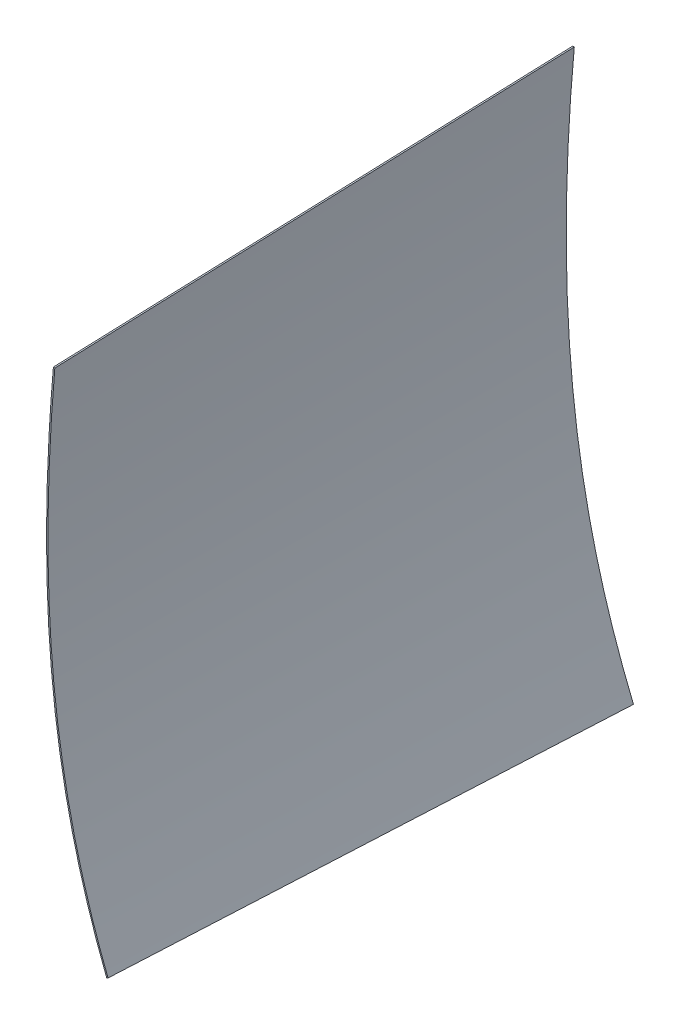
ISO-10303-21;
HEADER;
FILE_DESCRIPTION(('STEP AP214'),'2;1');
FILE_NAME('part.step','',(''),(''),'','','');
FILE_SCHEMA(('AUTOMOTIVE_DESIGN { 1 0 10303 214 1 1 1 1 }'));
ENDSEC;
DATA;
#1=APPLICATION_CONTEXT('core data for automotive mechanical design processes');
#2=APPLICATION_PROTOCOL_DEFINITION('international standard','automotive_design',2000,#1);
#3=PRODUCT_CONTEXT('',#1,'mechanical');
#4=PRODUCT('Part','Part','',(#3));
#5=PRODUCT_RELATED_PRODUCT_CATEGORY('part','',(#4));
#6=PRODUCT_DEFINITION_FORMATION('','',#4);
#7=PRODUCT_DEFINITION_CONTEXT('part definition',#1,'design');
#8=PRODUCT_DEFINITION('design','',#6,#7);
#9=PRODUCT_DEFINITION_SHAPE('','',#8);
#10=(LENGTH_UNIT() NAMED_UNIT(*) SI_UNIT(.MILLI.,.METRE.));
#11=(NAMED_UNIT(*) PLANE_ANGLE_UNIT() SI_UNIT($,.RADIAN.));
#12=(NAMED_UNIT(*) SI_UNIT($,.STERADIAN.) SOLID_ANGLE_UNIT());
#13=UNCERTAINTY_MEASURE_WITH_UNIT(LENGTH_MEASURE(1.E-05),#10,'distance_accuracy_value','');
#14=(GEOMETRIC_REPRESENTATION_CONTEXT(3) GLOBAL_UNCERTAINTY_ASSIGNED_CONTEXT((#13)) GLOBAL_UNIT_ASSIGNED_CONTEXT((#10,
#11,#12)) REPRESENTATION_CONTEXT('',''));
#15=CARTESIAN_POINT('',(0.,0.,0.));
#16=DIRECTION('',(0.,0.,1.));
#17=DIRECTION('',(1.,0.,0.));
#18=AXIS2_PLACEMENT_3D('',#15,#16,#17);
#19=CARTESIAN_POINT('',(-466.611140214611,-2996.06608357652,-18.9639705593638));
#20=DIRECTION('',(-0.0340355254361657,0.,-0.999420623665676));
#21=DIRECTION('',(0.999420623665674,0.,-0.0340355254361649));
#22=AXIS2_PLACEMENT_3D('',#19,#20,#21);
#23=PLANE('',#22);
#24=CARTESIAN_POINT('',(-403.930987283559,-3259.1200239438,-21.0985592289505));
#25=CARTESIAN_POINT('',(-445.733833689982,-3153.75817323705,-19.67495258278));
#26=CARTESIAN_POINT('',(-468.70121232971,-3041.49687790168,-18.8927926179128));
#27=CARTESIAN_POINT('',(-474.470158611008,-2827.19923017659,-18.696329674035));
#28=CARTESIAN_POINT('',(-470.84962488944,-2750.93837704816,-18.8196278776696));
#29=CARTESIAN_POINT('',(-464.732969148089,-2683.51000000006,-19.027932156308));
#30=B_SPLINE_CURVE_WITH_KNOTS('',3,(#24,#25,#26,#27,#28,#29),.UNSPECIFIED.,.F.,.F.,(4,2,4),
(-56.739502562534,-25.56106888728,-9.08244148966291),.UNSPECIFIED.);
#31=CARTESIAN_POINT('',(-403.930987283559,-3259.1200239438,-21.0985592289505));
#32=VERTEX_POINT('',#31);
#33=CARTESIAN_POINT('',(-464.732969148083,-2683.51,-19.027932156308));
#34=VERTEX_POINT('',#33);
#35=EDGE_CURVE('E292',#32,#34,#30,.T.);
#36=ORIENTED_EDGE('',*,*,#35,.F.);
#37=DIRECTION('',(0.928901332385208,0.368973720543161,-0.0316339729013444));
#38=VECTOR('',#37,1.);
#39=CARTESIAN_POINT('',(-403.930987283559,-3259.1200239438,-21.0985592289505));
#40=LINE('',#39,#38);
#41=CARTESIAN_POINT('',(-405.346632914115,-3259.68233989391,-21.0503490542484));
#42=VERTEX_POINT('',#41);
#43=EDGE_CURVE('E11',#42,#32,#40,.T.);
#44=ORIENTED_EDGE('',*,*,#43,.F.);
#45=CARTESIAN_POINT('',(-466.24985061128,-2683.37223897629,-18.9762743693844));
#46=CARTESIAN_POINT('',(-466.52800454726,-2686.43853357676,-18.9668017658189));
#47=CARTESIAN_POINT('',(-467.068754704631,-2692.54817563492,-18.9483863806448));
#48=CARTESIAN_POINT('',(-468.112754832752,-2704.96556617701,-18.9128326887609));
#49=CARTESIAN_POINT('',(-469.330675907016,-2720.70635667756,-18.8713560744898));
#50=CARTESIAN_POINT('',(-470.642951911992,-2739.94017213858,-18.8266661788754));
#51=CARTESIAN_POINT('',(-472.173825744938,-2765.96523019636,-18.7745318782149));
#52=CARTESIAN_POINT('',(-473.643484071331,-2799.09279437813,-18.7244822873156));
#53=CARTESIAN_POINT('',(-474.584547280483,-2839.41721128649,-18.6924341385843));
#54=CARTESIAN_POINT('',(-474.597234534264,-2879.89590932481,-18.6920020709058));
#55=CARTESIAN_POINT('',(-473.552843034611,-2920.24749419559,-18.7275690910473));
#56=CARTESIAN_POINT('',(-471.451298298135,-2959.00502041135,-18.7991377355603));
#57=CARTESIAN_POINT('',(-467.251493918508,-3008.90219119633,-18.9421631498901));
#58=CARTESIAN_POINT('',(-459.380692331025,-3068.11953927663,-19.2102053148107));
#59=CARTESIAN_POINT('',(-445.756996624254,-3135.03979825284,-19.6741637631179));
#60=CARTESIAN_POINT('',(-430.934378251676,-3188.07769701693,-20.1789518300286));
#61=CARTESIAN_POINT('',(-417.001753178614,-3229.31217603775,-20.6534309470667));
#62=CARTESIAN_POINT('',(-409.347475200825,-3249.59842973105,-20.9140993449761));
#63=CARTESIAN_POINT('',(-405.346632914115,-3259.68233989391,-21.0503490542484));
#64=B_SPLINE_CURVE_WITH_KNOTS('',3,(#45,#46,#47,#48,#49,#50,#51,#52,#53,#54,#55,#56,#57,#58,#59,
#60,#61,#62,#63),.UNSPECIFIED.,.F.,.F.,(4,1,1,1,1,1,1,1,1,1,1,1,1,1,1,1,4),(-56.7395025625342,
-55.9948609832705,-55.2502194040068,-53.7609362454794,-52.271653086952,-50.7823699284246,
-47.8038036113698,-44.8252372943149,-41.8466709772601,-38.8681046602053,-35.8895383431505,
-32.9109720260957,-26.9538393919861,-20.9967067578765,-15.0395741237669,-12.0610078067121,
-9.08244148965729),.UNSPECIFIED.);
#65=CARTESIAN_POINT('',(-466.24985061128,-2683.37223897629,-18.9762743693844));
#66=VERTEX_POINT('',#65);
#67=EDGE_CURVE('E47',#66,#42,#64,.T.);
#68=ORIENTED_EDGE('',*,*,#67,.F.);
#69=DIRECTION('',(-0.995329044093503,0.0903943725162506,0.0338961856453834));
#70=VECTOR('',#69,1.);
#71=CARTESIAN_POINT('',(-464.732969148083,-2683.51,-19.027932156308));
#72=LINE('',#71,#70);
#73=EDGE_CURVE('E151',#34,#66,#72,.T.);
#74=ORIENTED_EDGE('',*,*,#73,.F.);
#75=EDGE_LOOP('',(#36,#44,#68,#74));
#76=FACE_BOUND('',#75,.T.);
#77=ADVANCED_FACE('F37',(#76),#23,.T.);
#78=CARTESIAN_POINT('',(-446.435916270369,-2973.01654152757,552.449999999997));
#79=DIRECTION('',(0.,0.,-1.));
#80=DIRECTION('',(1.,0.,0.));
#81=AXIS2_PLACEMENT_3D('',#78,#79,#80);
#82=PLANE('',#81);
#83=CARTESIAN_POINT('',(-445.27114172974,-2683.51,552.449999999998));
#84=CARTESIAN_POINT('',(-450.721614948777,-2745.57602142326,552.449999999998));
#85=CARTESIAN_POINT('',(-453.875260666029,-2815.15896694759,552.449999999998));
#86=CARTESIAN_POINT('',(-448.538626648824,-3013.430965814,552.449999999998));
#87=CARTESIAN_POINT('',(-427.328274562888,-3118.30445867765,552.449999999998));
#88=CARTESIAN_POINT('',(-388.74883320951,-3216.60244101189,552.449999999999));
#89=B_SPLINE_CURVE_WITH_KNOTS('',3,(#83,#84,#85,#86,#87,#88),.UNSPECIFIED.,.F.,.F.,(4,2,4),
(-53.1349686655124,-38.0838438024245,-9.03456928373366),.UNSPECIFIED.);
#90=CARTESIAN_POINT('',(-445.27114172974,-2683.51,552.449999999998));
#91=VERTEX_POINT('',#90);
#92=CARTESIAN_POINT('',(-388.74883320951,-3216.60244101189,552.449999999999));
#93=VERTEX_POINT('',#92);
#94=EDGE_CURVE('E93',#91,#93,#89,.T.);
#95=ORIENTED_EDGE('',*,*,#94,.F.);
#96=DIRECTION('',(0.996166217031828,-0.0874806724053839,0.));
#97=VECTOR('',#96,1.);
#98=CARTESIAN_POINT('',(-445.27114172974,-2683.51,552.449999999998));
#99=LINE('',#98,#97);
#100=CARTESIAN_POINT('',(-446.789299044496,-2683.37667945526,552.449999999998));
#101=VERTEX_POINT('',#100);
#102=EDGE_CURVE('E105',#101,#91,#99,.T.);
#103=ORIENTED_EDGE('',*,*,#102,.F.);
#104=CARTESIAN_POINT('',(-390.16748320148,-3217.1592248122,552.449999999999));
#105=CARTESIAN_POINT('',(-393.835931652234,-3207.81224962655,552.449999999999));
#106=CARTESIAN_POINT('',(-400.853820334561,-3189.01432562217,552.449999999999));
#107=CARTESIAN_POINT('',(-413.641001817294,-3150.79551758123,552.449999999998));
#108=CARTESIAN_POINT('',(-427.264915015265,-3101.64576821892,552.449999999998));
#109=CARTESIAN_POINT('',(-439.826984081324,-3039.67173926073,552.449999999997));
#110=CARTESIAN_POINT('',(-447.127533927637,-2984.88729053723,552.449999999997));
#111=CARTESIAN_POINT('',(-451.06175416571,-2938.77653944781,552.449999999997));
#112=CARTESIAN_POINT('',(-452.724263374413,-2908.94187235699,552.449999999997));
#113=CARTESIAN_POINT('',(-453.577877688286,-2884.37336277367,552.449999999997));
#114=CARTESIAN_POINT('',(-454.10627755663,-2859.4667689179,552.449999999997));
#115=CARTESIAN_POINT('',(-454.165478379712,-2828.26453296398,552.449999999997));
#116=CARTESIAN_POINT('',(-453.380335328475,-2790.9185255314,552.449999999997));
#117=CARTESIAN_POINT('',(-452.09337534734,-2760.19726274656,552.449999999998));
#118=CARTESIAN_POINT('',(-450.733957511632,-2736.02940774471,552.449999999998));
#119=CARTESIAN_POINT('',(-449.561553012373,-2718.14988851083,552.449999999998));
#120=CARTESIAN_POINT('',(-448.468208407518,-2703.49986711604,552.449999999998));
#121=CARTESIAN_POINT('',(-447.528245891984,-2691.9325270238,552.449999999998));
#122=CARTESIAN_POINT('',(-447.040334870055,-2686.23529269873,552.449999999998));
#123=CARTESIAN_POINT('',(-446.789299044496,-2683.37667945526,552.449999999998));
#124=B_SPLINE_CURVE_WITH_KNOTS('',3,(#104,#105,#106,#107,#108,#109,#110,#111,#112,#113,#114,
#115,#116,#117,#118,#119,#120,#121,#122,#123),.UNSPECIFIED.,.F.,.F.,(4,1,1,1,1,1,1,1,1,1,1,1,1,
1,1,1,1,4),(-53.1349686655124,-50.3786937041512,-47.6224187427901,-42.1098688200677,
-36.5973188973454,-31.084768974623,-28.3284940132619,-25.5722190519007,-24.1940815712201,
-22.8159440905395,-20.0596691291783,-17.3033941678172,-14.547119206456,-13.1689817257754,
-11.7908442450948,-10.4127067644142,-9.72363802407395,-9.03456928373366),.UNSPECIFIED.);
#125=CARTESIAN_POINT('',(-390.16748320148,-3217.1592248122,552.449999999999));
#126=VERTEX_POINT('',#125);
#127=EDGE_CURVE('E96',#126,#101,#124,.T.);
#128=ORIENTED_EDGE('',*,*,#127,.F.);
#129=DIRECTION('',(-0.930872698143799,-0.365343700986461,0.));
#130=VECTOR('',#129,1.);
#131=CARTESIAN_POINT('',(-388.74883320951,-3216.60244101189,552.449999999999));
#132=LINE('',#131,#130);
#133=EDGE_CURVE('E80',#93,#126,#132,.T.);
#134=ORIENTED_EDGE('',*,*,#133,.F.);
#135=EDGE_LOOP('',(#95,#103,#128,#134));
#136=FACE_BOUND('',#135,.T.);
#137=ADVANCED_FACE('F91',(#136),#82,.F.);
#138=CARTESIAN_POINT('',(-388.74883320951,-3216.60244101189,552.449999999999));
#139=CARTESIAN_POINT('',(-393.809551234193,-3230.77496865587,361.267146923683));
#140=CARTESIAN_POINT('',(-398.870269258875,-3244.94749629983,170.084293847366));
#141=CARTESIAN_POINT('',(-403.930987283559,-3259.1200239438,-21.0985592289505));
#142=CARTESIAN_POINT('',(-396.069879947334,-3197.94887585756,552.449999999999));
#143=CARTESIAN_POINT('',(-401.352613939785,-3211.62890949383,361.357814441903));
#144=CARTESIAN_POINT('',(-406.635347932235,-3225.3089431301,170.265628883808));
#145=CARTESIAN_POINT('',(-411.918081924685,-3238.98897676636,-20.8265566742876));
#146=CARTESIAN_POINT('',(-409.462453802416,-3160.1633580475,552.449999999999));
#147=CARTESIAN_POINT('',(-415.148035207749,-3172.84747091845,361.523562691919));
#148=CARTESIAN_POINT('',(-420.833616613079,-3185.53158378938,170.597125383837));
#149=CARTESIAN_POINT('',(-426.519198018413,-3198.21569666032,-20.3293119242431));
#150=CARTESIAN_POINT('',(-425.77920252708,-3101.29956753378,552.449999999998));
#151=CARTESIAN_POINT('',(-431.943278671712,-3112.43172360443,361.725081639181));
#152=CARTESIAN_POINT('',(-438.107354816344,-3123.56387967509,171.000163278365));
#153=CARTESIAN_POINT('',(-444.271430960977,-3134.69603574574,-19.7247550824509));
#154=CARTESIAN_POINT('',(-436.234798255945,-3049.72310201449,552.449999999999));
#155=CARTESIAN_POINT('',(-442.694501806457,-3059.47823062877,361.853838636825));
#156=CARTESIAN_POINT('',(-449.15420535697,-3069.23335924305,171.257677273652));
#157=CARTESIAN_POINT('',(-455.613908907483,-3078.98848785733,-19.3384840895217));
#158=CARTESIAN_POINT('',(-442.695163646222,-3006.60229322652,552.449999999995));
#159=CARTESIAN_POINT('',(-449.327146150586,-3015.19936674817,361.933042107011));
#160=CARTESIAN_POINT('',(-455.959128654953,-3023.79644026981,171.416084214028));
#161=CARTESIAN_POINT('',(-462.591111159319,-3032.39351379145,-19.1008736789566));
#162=CARTESIAN_POINT('',(-446.595338289244,-2973.20952160743,552.449999999998));
#163=CARTESIAN_POINT('',(-453.325842237494,-2980.89808891288,361.980671095654));
#164=CARTESIAN_POINT('',(-460.05634618574,-2988.58665621833,171.51134219131));
#165=CARTESIAN_POINT('',(-466.786850133986,-2996.27522352377,-18.9579867130343));
#166=CARTESIAN_POINT('',(-449.540346440592,-2938.66280502973,552.449999999997));
#167=CARTESIAN_POINT('',(-456.337060732763,-2945.40868607614,362.016356908295));
#168=CARTESIAN_POINT('',(-463.133775024936,-2952.15456712255,171.582713816592));
#169=CARTESIAN_POINT('',(-469.930489317107,-2958.90044816896,-18.8509292751098));
#170=CARTESIAN_POINT('',(-451.53540564562,-2902.92639756038,552.449999999996));
#171=CARTESIAN_POINT('',(-458.367464028044,-2908.67912835782,362.040207977829));
#172=CARTESIAN_POINT('',(-465.199522410469,-2914.43185915525,171.630415955661));
#173=CARTESIAN_POINT('',(-472.031580792892,-2920.18458995268,-18.7793760665063));
#174=CARTESIAN_POINT('',(-452.571553541693,-2865.70482179759,552.449999999998));
#175=CARTESIAN_POINT('',(-459.405821753868,-2870.4300086038,362.052045328184));
#176=CARTESIAN_POINT('',(-466.240089966043,-2875.15519541001,171.654090656371));
#177=CARTESIAN_POINT('',(-473.074358178216,-2879.88038221622,-18.743864015442));
#178=CARTESIAN_POINT('',(-452.640725782512,-2828.27319493841,552.449999999998));
#179=CARTESIAN_POINT('',(-459.447415375366,-2831.9942461404,362.051891357365));
#180=CARTESIAN_POINT('',(-466.254104968221,-2835.71529734239,171.653782714733));
#181=CARTESIAN_POINT('',(-473.060794561072,-2839.43634854438,-18.7443259278988));
#182=CARTESIAN_POINT('',(-451.857406362833,-2790.96907925551,552.449999999998));
#183=CARTESIAN_POINT('',(-458.612141519539,-2793.69391470801,362.041229987876));
#184=CARTESIAN_POINT('',(-465.366876676243,-2796.41875016052,171.632459975754));
#185=CARTESIAN_POINT('',(-472.121611832945,-2799.14358561301,-18.7763100363671));
#186=CARTESIAN_POINT('',(-450.313701225434,-2754.13084657163,552.449999999997));
#187=CARTESIAN_POINT('',(-456.995351268354,-2755.89498847126,362.021217297591));
#188=CARTESIAN_POINT('',(-463.677001311274,-2757.65913037089,171.592434595184));
#189=CARTESIAN_POINT('',(-470.358651354194,-2759.42327227052,-18.8363481072216));
#190=CARTESIAN_POINT('',(-448.111630814615,-2718.11246333902,552.449999999998));
#191=CARTESIAN_POINT('',(-454.703379029596,-2718.95838307462,361.993158310433));
#192=CARTESIAN_POINT('',(-461.295127244577,-2719.80430281023,171.536316620869));
#193=CARTESIAN_POINT('',(-467.886875459559,-2720.65022254584,-18.9205250686957));
#194=CARTESIAN_POINT('',(-446.269273297836,-2694.87599572168,552.449999999998));
#195=CARTESIAN_POINT('',(-452.79237382238,-2695.14996441787,361.969906509968));
#196=CARTESIAN_POINT('',(-459.315474346923,-2695.42393311407,171.489813019939));
#197=CARTESIAN_POINT('',(-465.838574871466,-2695.69790181027,-18.9902804700912));
#198=CARTESIAN_POINT('',(-445.27114172974,-2683.51,552.449999999998));
#199=CARTESIAN_POINT('',(-451.758417535858,-2683.51000000002,361.957355947896));
#200=CARTESIAN_POINT('',(-458.245693341971,-2683.51000000004,171.464711895794));
#201=CARTESIAN_POINT('',(-464.732969148089,-2683.51000000006,-19.027932156308));
#202=B_SPLINE_SURFACE_WITH_KNOTS('',3,3,((#138,#139,#140,#141),(#142,#143,#144,#145),(#146,#147,
#148,#149),(#150,#151,#152,#153),(#154,#155,#156,#157),(#158,#159,#160,#161),(#162,#163,#164,
#165),(#166,#167,#168,#169),(#170,#171,#172,#173),(#174,#175,#176,#177),(#178,#179,#180,#181),
(#182,#183,#184,#185),(#186,#187,#188,#189),(#190,#191,#192,#193),(#194,#195,#196,#197),(#198,
#199,#200,#201)),.UNSPECIFIED.,.F.,.F.,.F.,(4,1,1,1,1,1,1,1,1,1,1,1,1,4),(4,4),
(0.501665890350855,0.563957654056998,0.626249417763141,0.688541181469285,0.719687063322356,
0.750832945175428,0.781978827028499,0.813124708881571,0.844270590734642,0.875416472587714,
0.906562354440785,0.937708236293857,0.968854118146928,1.),(0.,1.),.UNSPECIFIED.);
#203=CARTESIAN_POINT('',(-388.74883320951,-3216.60244101189,552.449999999999));
#204=CARTESIAN_POINT('',(-393.809551234193,-3230.77496865587,361.267146923683));
#205=CARTESIAN_POINT('',(-398.870269258875,-3244.94749629983,170.084293847366));
#206=CARTESIAN_POINT('',(-403.930987283559,-3259.1200239438,-21.0985592289505));
#207=B_SPLINE_CURVE_WITH_KNOTS('',3,(#203,#204,#205,#206),.UNSPECIFIED.,.F.,.F.,(4,4),(0.,1.),.UNSPECIFIED.);
#208=EDGE_CURVE('E62',#93,#32,#207,.T.);
#209=CARTESIAN_POINT('',(-445.27114172974,-2683.51,552.449999999998));
#210=CARTESIAN_POINT('',(-451.758417535855,-2683.51,361.957355947896));
#211=CARTESIAN_POINT('',(-458.245693341967,-2683.51,171.464711895794));
#212=CARTESIAN_POINT('',(-464.732969148083,-2683.51,-19.027932156308));
#213=B_SPLINE_CURVE_WITH_KNOTS('',3,(#209,#210,#211,#212),.UNSPECIFIED.,.F.,.F.,(4,4),(0.,1.),.UNSPECIFIED.);
#214=EDGE_CURVE('E86',#91,#34,#213,.T.);
#215=ORIENTED_EDGE('',*,*,#94,.T.);
#216=ORIENTED_EDGE('',*,*,#208,.T.);
#217=ORIENTED_EDGE('',*,*,#35,.T.);
#218=ORIENTED_EDGE('',*,*,#214,.F.);
#219=EDGE_LOOP('',(#215,#216,#217,#218));
#220=FACE_BOUND('',#219,.T.);
#221=ADVANCED_FACE('F103',(#220),#202,.F.);
#222=CARTESIAN_POINT('',(-390.16748320148,-3217.1592248122,552.449999999999));
#223=CARTESIAN_POINT('',(-395.227199772356,-3231.3335965061,361.283216981916));
#224=CARTESIAN_POINT('',(-400.286916343237,-3245.50796820001,170.116433963834));
#225=CARTESIAN_POINT('',(-405.346632914115,-3259.68233989391,-21.0503490542484));
#226=CARTESIAN_POINT('',(-390.049262368816,-3217.11282616217,552.449999999999));
#227=CARTESIAN_POINT('',(-395.109062394178,-3231.28704418525,361.281877810397));
#228=CARTESIAN_POINT('',(-400.168862419538,-3245.46126220832,170.113755620795));
#229=CARTESIAN_POINT('',(-405.2286624449,-3259.6354802314,-21.0543665688068));
#230=CARTESIAN_POINT('',(-389.812820703488,-3217.02002886213,552.449999999999));
#231=CARTESIAN_POINT('',(-394.872787637816,-3231.19393954355,361.279199467359));
#232=CARTESIAN_POINT('',(-399.932754572146,-3245.36785022497,170.108398934717));
#233=CARTESIAN_POINT('',(-404.992721506476,-3259.54176090638,-21.0624015979244));
#234=CARTESIAN_POINT('',(-389.458158205493,-3216.88083291204,552.449999999998));
#235=CARTESIAN_POINT('',(-394.518375503275,-3231.05428258098,361.275181952799));
#236=CARTESIAN_POINT('',(-399.578592801056,-3245.22773224992,170.1003639056));
#237=CARTESIAN_POINT('',(-404.638810098837,-3259.40118191886,-21.0744541415995));
#238=CARTESIAN_POINT('',(-389.103495707503,-3216.74163696197,552.449999999999));
#239=CARTESIAN_POINT('',(-394.163963368735,-3230.91462561843,361.271164438241));
#240=CARTESIAN_POINT('',(-399.224431029965,-3245.08761427488,170.092328876483));
#241=CARTESIAN_POINT('',(-404.284898691199,-3259.26060293133,-21.0865066852746));
#242=CARTESIAN_POINT('',(-388.867054042175,-3216.64883966192,552.449999999999));
#243=CARTESIAN_POINT('',(-393.927688612374,-3230.82152097672,361.268486095202));
#244=CARTESIAN_POINT('',(-398.988323182573,-3244.99420229152,170.086972190405));
#245=CARTESIAN_POINT('',(-404.048957752773,-3259.16688360631,-21.0945417143913));
#246=CARTESIAN_POINT('',(-388.74883320951,-3216.60244101189,552.449999999999));
#247=CARTESIAN_POINT('',(-393.809551234193,-3230.77496865587,361.267146923683));
#248=CARTESIAN_POINT('',(-398.870269258875,-3244.94749629983,170.084293847366));
#249=CARTESIAN_POINT('',(-403.930987283559,-3259.1200239438,-21.0985592289505));
#250=B_SPLINE_SURFACE_WITH_KNOTS('',3,3,((#222,#223,#224,#225),(#226,#227,#228,#229),(#230,#231,
#232,#233),(#234,#235,#236,#237),(#238,#239,#240,#241),(#242,#243,#244,#245),(#246,#247,#248,
#249)),.UNSPECIFIED.,.F.,.F.,.F.,(4,1,1,1,4),(4,4),(0.500314223497019,0.500652140210478,
0.500990056923937,0.501327973637396,0.501665890350855),(0.,1.),.UNSPECIFIED.);
#251=CARTESIAN_POINT('',(-390.16748320148,-3217.1592248122,552.449999999999));
#252=CARTESIAN_POINT('',(-395.227199772356,-3231.3335965061,361.283216981916));
#253=CARTESIAN_POINT('',(-400.286916343237,-3245.50796820001,170.116433963834));
#254=CARTESIAN_POINT('',(-405.346632914115,-3259.68233989391,-21.0503490542484));
#255=B_SPLINE_CURVE_WITH_KNOTS('',3,(#251,#252,#253,#254),.UNSPECIFIED.,.F.,.F.,(4,4),(0.,1.),.UNSPECIFIED.);
#256=EDGE_CURVE('E54',#126,#42,#255,.T.);
#257=ORIENTED_EDGE('',*,*,#133,.T.);
#258=ORIENTED_EDGE('',*,*,#256,.T.);
#259=ORIENTED_EDGE('',*,*,#43,.T.);
#260=ORIENTED_EDGE('',*,*,#208,.F.);
#261=EDGE_LOOP('',(#257,#258,#259,#260));
#262=FACE_BOUND('',#261,.T.);
#263=ADVANCED_FACE('F79',(#262),#250,.F.);
#264=CARTESIAN_POINT('',(-446.789299044496,-2683.37667945526,552.449999999998));
#265=CARTESIAN_POINT('',(-453.276149566759,-2683.3751992956,361.974575210204));
#266=CARTESIAN_POINT('',(-459.763000089021,-2683.37371913595,171.499150420409));
#267=CARTESIAN_POINT('',(-466.24985061128,-2683.37223897629,-18.9762743693844));
#268=CARTESIAN_POINT('',(-447.793442346731,-2694.81113242914,552.449999999998));
#269=CARTESIAN_POINT('',(-454.316450349554,-2695.08656074548,361.987205348291));
#270=CARTESIAN_POINT('',(-460.839458352375,-2695.36198906182,171.524410696584));
#271=CARTESIAN_POINT('',(-467.362466355199,-2695.63741737815,-18.9383839551223));
#272=CARTESIAN_POINT('',(-449.628368863025,-2717.96540965835,552.449999999999));
#273=CARTESIAN_POINT('',(-456.2194651953,-2718.80775244859,362.0103537447));
#274=CARTESIAN_POINT('',(-462.81056152757,-2719.65009523883,171.570707489401));
#275=CARTESIAN_POINT('',(-469.401657859842,-2720.49243802907,-18.8689387658973));
#276=CARTESIAN_POINT('',(-451.837488821076,-2754.07069820279,552.449999999998));
#277=CARTESIAN_POINT('',(-458.518952553183,-2755.83486527565,362.038508611739));
#278=CARTESIAN_POINT('',(-465.200416285291,-2757.59903234853,171.627017223481));
#279=CARTESIAN_POINT('',(-471.881880017395,-2759.36319942139,-18.784474164776));
#280=CARTESIAN_POINT('',(-453.379890903244,-2790.91216185459,552.449999999998));
#281=CARTESIAN_POINT('',(-460.134125474159,-2793.63465413662,362.05849580735));
#282=CARTESIAN_POINT('',(-466.888360045077,-2796.35714641865,171.666991614702));
#283=CARTESIAN_POINT('',(-473.642594615992,-2799.07963870068,-18.7245125779452));
#284=CARTESIAN_POINT('',(-454.165076006901,-2828.26248199465,552.449999999996));
#285=CARTESIAN_POINT('',(-460.971635841517,-2831.98363415068,362.069190984248));
#286=CARTESIAN_POINT('',(-467.778195676137,-2835.7047863067,171.688381968499));
#287=CARTESIAN_POINT('',(-474.584755510756,-2839.42593846273,-18.6924270472497));
#288=CARTESIAN_POINT('',(-454.095941642793,-2865.71985989404,552.449999999998));
#289=CARTESIAN_POINT('',(-460.92983283365,-2870.44258114125,362.069336964427));
#290=CARTESIAN_POINT('',(-467.763724024502,-2875.16530238847,171.688673928856));
#291=CARTESIAN_POINT('',(-474.597615215358,-2879.88802363568,-18.6919891067134));
#292=CARTESIAN_POINT('',(-453.057231438139,-2902.99864255074,552.449999999996));
#293=CARTESIAN_POINT('',(-459.888731722477,-2908.75165394108,362.057464360764));
#294=CARTESIAN_POINT('',(-466.720232006819,-2914.50466533143,171.664928721532));
#295=CARTESIAN_POINT('',(-473.551732291159,-2920.25767672176,-18.7276069177003));
#296=CARTESIAN_POINT('',(-451.062732070145,-2938.75914982817,552.449999999998));
#297=CARTESIAN_POINT('',(-457.859652198106,-2945.502386229,362.033645662326));
#298=CARTESIAN_POINT('',(-464.656572326067,-2952.24562262983,171.617291324654));
#299=CARTESIAN_POINT('',(-471.453492454029,-2958.98885903067,-18.7990630130184));
#300=CARTESIAN_POINT('',(-447.124325549857,-2984.91695503118,552.449999999995));
#301=CARTESIAN_POINT('',(-453.831634418028,-2992.92491535486,361.985886113493));
#302=CARTESIAN_POINT('',(-460.538943286199,-3000.93287567854,171.521772226991));
#303=CARTESIAN_POINT('',(-467.24625215437,-3008.94083600222,-18.9423416595105));
#304=CARTESIAN_POINT('',(-439.829755830383,-3039.65121439149,552.449999999999));
#305=CARTESIAN_POINT('',(-446.348324547405,-3049.13113923506,361.896652372285));
#306=CARTESIAN_POINT('',(-452.866893264424,-3058.61106407862,171.34330474457));
#307=CARTESIAN_POINT('',(-459.385461981445,-3068.09098892219,-19.2100428831434));
#308=CARTESIAN_POINT('',(-427.263866015604,-3101.65436833452,552.449999999996));
#309=CARTESIAN_POINT('',(-433.427342920811,-3112.78755377607,361.741914763774));
#310=CARTESIAN_POINT('',(-439.590819826018,-3123.92073921763,171.033829527554));
#311=CARTESIAN_POINT('',(-445.754296731226,-3135.05392465918,-19.6742557086669));
#312=CARTESIAN_POINT('',(-410.914916681464,-3160.62625565427,552.449999999999));
#313=CARTESIAN_POINT('',(-416.600100211757,-3173.31102152984,361.540037140693));
#314=CARTESIAN_POINT('',(-422.285283742052,-3185.99578740541,170.630074281387));
#315=CARTESIAN_POINT('',(-427.970467272347,-3198.68055328098,-20.2798885779192));
#316=CARTESIAN_POINT('',(-397.504380102988,-3198.4652744409,552.449999999999));
#317=CARTESIAN_POINT('',(-402.785692564506,-3212.14835614999,361.374050121431));
#318=CARTESIAN_POINT('',(-408.067005026024,-3225.8314378591,170.298100242864));
#319=CARTESIAN_POINT('',(-413.348317487542,-3239.5145195682,-20.7778496357029));
#320=CARTESIAN_POINT('',(-390.16748320148,-3217.1592248122,552.449999999999));
#321=CARTESIAN_POINT('',(-395.227199772356,-3231.3335965061,361.283216981916));
#322=CARTESIAN_POINT('',(-400.286916343237,-3245.50796820001,170.116433963834));
#323=CARTESIAN_POINT('',(-405.346632914115,-3259.68233989391,-21.0503490542484));
#324=B_SPLINE_SURFACE_WITH_KNOTS('',3,3,((#264,#265,#266,#267),(#268,#269,#270,#271),(#272,#273,
#274,#275),(#276,#277,#278,#279),(#280,#281,#282,#283),(#284,#285,#286,#287),(#288,#289,#290,
#291),(#292,#293,#294,#295),(#296,#297,#298,#299),(#300,#301,#302,#303),(#304,#305,#306,#307),
(#308,#309,#310,#311),(#312,#313,#314,#315),(#316,#317,#318,#319),(#320,#321,#322,#323)),
.UNSPECIFIED.,.F.,.F.,.F.,(4,1,1,1,1,1,1,1,1,1,1,1,4),(4,4),(0.00135166685383582,
0.0325368266440348,0.0637219864342337,0.0949071462244327,0.126092306014632,0.157277465804831,
0.18846262559503,0.219647785385229,0.250832945175428,0.313203264755826,0.375573584336223,
0.437943903916621,0.500314223497019),(0.,1.),.UNSPECIFIED.);
#325=CARTESIAN_POINT('',(-446.789299044496,-2683.37667945526,552.449999999998));
#326=CARTESIAN_POINT('',(-453.276149566759,-2683.3751992956,361.974575210204));
#327=CARTESIAN_POINT('',(-459.763000089021,-2683.37371913595,171.499150420409));
#328=CARTESIAN_POINT('',(-466.24985061128,-2683.37223897629,-18.9762743693844));
#329=B_SPLINE_CURVE_WITH_KNOTS('',3,(#325,#326,#327,#328),.UNSPECIFIED.,.F.,.F.,(4,4),(0.,1.),.UNSPECIFIED.);
#330=EDGE_CURVE('E98',#101,#66,#329,.T.);
#331=ORIENTED_EDGE('',*,*,#127,.T.);
#332=ORIENTED_EDGE('',*,*,#330,.T.);
#333=ORIENTED_EDGE('',*,*,#67,.T.);
#334=ORIENTED_EDGE('',*,*,#256,.F.);
#335=EDGE_LOOP('',(#331,#332,#333,#334));
#336=FACE_BOUND('',#335,.T.);
#337=ADVANCED_FACE('F169',(#336),#324,.F.);
#338=CARTESIAN_POINT('',(-445.27114172974,-2683.51,552.449999999998));
#339=CARTESIAN_POINT('',(-451.758417535855,-2683.51,361.957355947896));
#340=CARTESIAN_POINT('',(-458.245693341967,-2683.51,171.464711895794));
#341=CARTESIAN_POINT('',(-464.732969148083,-2683.51,-19.027932156308));
#342=CARTESIAN_POINT('',(-445.397654839304,-2683.49888995461,552.449999999998));
#343=CARTESIAN_POINT('',(-451.884895205097,-2683.49876660797,361.958790886422));
#344=CARTESIAN_POINT('',(-458.37213557089,-2683.49864326133,171.467581772846));
#345=CARTESIAN_POINT('',(-464.85937593668,-2683.49851991469,-19.0236273407312));
#346=CARTESIAN_POINT('',(-445.650681058431,-2683.47666986382,552.449999999998));
#347=CARTESIAN_POINT('',(-452.137850543581,-2683.4762998239,361.961660763473));
#348=CARTESIAN_POINT('',(-458.625020028732,-2683.47592978399,171.473321526948));
#349=CARTESIAN_POINT('',(-465.112189513881,-2683.47555974407,-19.0150177095774));
#350=CARTESIAN_POINT('',(-446.030220387119,-2683.44333972763,552.449999999998));
#351=CARTESIAN_POINT('',(-452.517283551305,-2683.4425996478,361.96596557905));
#352=CARTESIAN_POINT('',(-459.004346715493,-2683.44185956797,171.481931158102));
#353=CARTESIAN_POINT('',(-465.491409879681,-2683.44111948815,-19.0021032628458));
#354=CARTESIAN_POINT('',(-446.409759715808,-2683.41000959144,552.449999999997));
#355=CARTESIAN_POINT('',(-452.896716559032,-2683.4088994717,361.970270394626));
#356=CARTESIAN_POINT('',(-459.383673402257,-2683.40778935196,171.490540789256));
#357=CARTESIAN_POINT('',(-465.870630245481,-2683.40667923222,-18.9891888161151));
#358=CARTESIAN_POINT('',(-446.662785934933,-2683.38778950065,552.449999999998));
#359=CARTESIAN_POINT('',(-453.149671897518,-2683.38643268764,361.973140271678));
#360=CARTESIAN_POINT('',(-459.636557860099,-2683.38507587462,171.496280543359));
#361=CARTESIAN_POINT('',(-466.12344382268,-2683.3837190616,-18.9805791849613));
#362=CARTESIAN_POINT('',(-446.789299044496,-2683.37667945526,552.449999999998));
#363=CARTESIAN_POINT('',(-453.276149566759,-2683.3751992956,361.974575210204));
#364=CARTESIAN_POINT('',(-459.763000089021,-2683.37371913595,171.499150420409));
#365=CARTESIAN_POINT('',(-466.24985061128,-2683.37223897629,-18.9762743693844));
#366=B_SPLINE_SURFACE_WITH_KNOTS('',3,3,((#338,#339,#340,#341),(#342,#343,#344,#345),(#346,#347,
#348,#349),(#350,#351,#352,#353),(#354,#355,#356,#357),(#358,#359,#360,#361),(#362,#363,#364,
#365)),.UNSPECIFIED.,.F.,.F.,.F.,(4,1,1,1,4),(4,4),(0.,0.000337916713458955,0.00067583342691791,
0.00101375014037687,0.00135166685383582),(0.,1.),.UNSPECIFIED.);
#367=ORIENTED_EDGE('',*,*,#102,.T.);
#368=ORIENTED_EDGE('',*,*,#214,.T.);
#369=ORIENTED_EDGE('',*,*,#73,.T.);
#370=ORIENTED_EDGE('',*,*,#330,.F.);
#371=EDGE_LOOP('',(#367,#368,#369,#370));
#372=FACE_BOUND('',#371,.T.);
#373=ADVANCED_FACE('F158',(#372),#366,.F.);
#374=CLOSED_SHELL('',(#77,#137,#221,#263,#337,#373));
#375=MANIFOLD_SOLID_BREP('B2',#374);
#376=ADVANCED_BREP_SHAPE_REPRESENTATION('',(#18,#375),#14);
#377=SHAPE_DEFINITION_REPRESENTATION(#9,#376);
ENDSEC;
END-ISO-10303-21;
